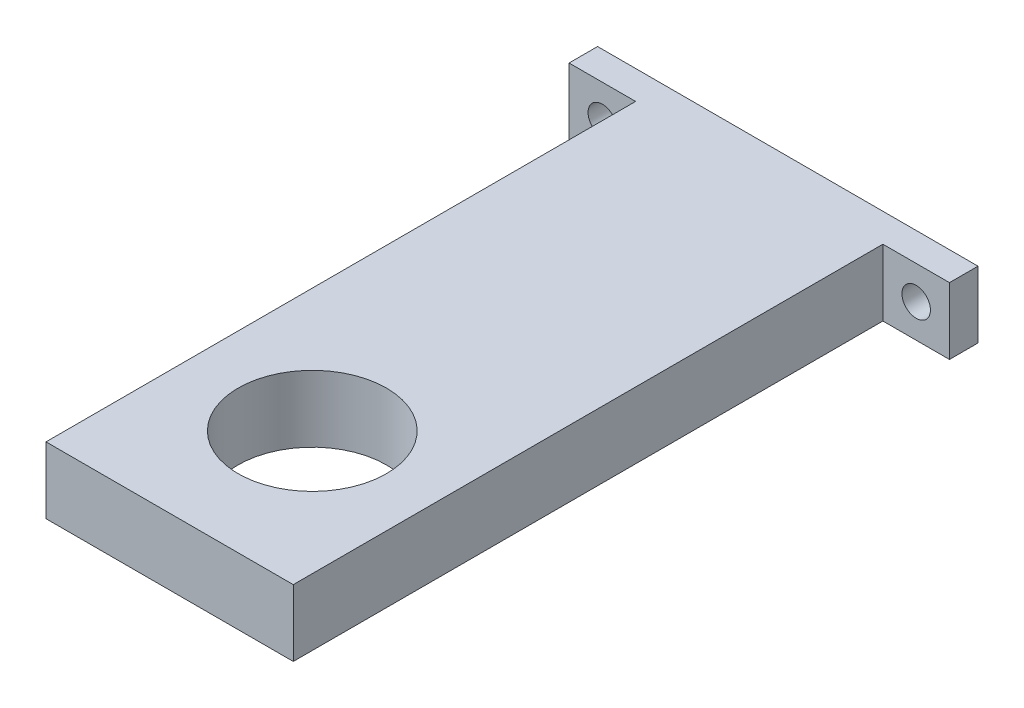
ISO-10303-21;
HEADER;
FILE_DESCRIPTION(('STEP AP214'),'2;1');
FILE_NAME('part.step','',(''),(''),'','','');
FILE_SCHEMA(('AUTOMOTIVE_DESIGN { 1 0 10303 214 1 1 1 1 }'));
ENDSEC;
DATA;
#1=APPLICATION_CONTEXT('core data for automotive mechanical design processes');
#2=APPLICATION_PROTOCOL_DEFINITION('international standard','automotive_design',2000,#1);
#3=PRODUCT_CONTEXT('',#1,'mechanical');
#4=PRODUCT('Part','Part','',(#3));
#5=PRODUCT_RELATED_PRODUCT_CATEGORY('part','',(#4));
#6=PRODUCT_DEFINITION_FORMATION('','',#4);
#7=PRODUCT_DEFINITION_CONTEXT('part definition',#1,'design');
#8=PRODUCT_DEFINITION('design','',#6,#7);
#9=PRODUCT_DEFINITION_SHAPE('','',#8);
#10=(LENGTH_UNIT() NAMED_UNIT(*) SI_UNIT(.MILLI.,.METRE.));
#11=(NAMED_UNIT(*) PLANE_ANGLE_UNIT() SI_UNIT($,.RADIAN.));
#12=(NAMED_UNIT(*) SI_UNIT($,.STERADIAN.) SOLID_ANGLE_UNIT());
#13=UNCERTAINTY_MEASURE_WITH_UNIT(LENGTH_MEASURE(1.E-05),#10,'distance_accuracy_value','');
#14=(GEOMETRIC_REPRESENTATION_CONTEXT(3) GLOBAL_UNCERTAINTY_ASSIGNED_CONTEXT((#13)) GLOBAL_UNIT_ASSIGNED_CONTEXT((#10,
#11,#12)) REPRESENTATION_CONTEXT('',''));
#15=CARTESIAN_POINT('',(0.,0.,0.));
#16=DIRECTION('',(0.,0.,1.));
#17=DIRECTION('',(1.,0.,0.));
#18=AXIS2_PLACEMENT_3D('',#15,#16,#17);
#19=CARTESIAN_POINT('',(0.,0.,3.));
#20=DIRECTION('',(0.,0.,1.));
#21=DIRECTION('',(1.,0.,0.));
#22=AXIS2_PLACEMENT_3D('',#19,#20,#21);
#23=PLANE('',#22);
#24=CARTESIAN_POINT('',(-16.5,0.,3.));
#25=DIRECTION('',(0.,0.,1.));
#26=DIRECTION('',(1.,0.,0.));
#27=AXIS2_PLACEMENT_3D('',#24,#25,#26);
#28=CIRCLE('',#27,1.5);
#29=CARTESIAN_POINT('',(-15.,0.,3.));
#30=VERTEX_POINT('',#29);
#31=EDGE_CURVE('E156',#30,#30,#28,.T.);
#32=ORIENTED_EDGE('',*,*,#31,.F.);
#33=EDGE_LOOP('',(#32));
#34=FACE_BOUND('',#33,.T.);
#35=DIRECTION('',(0.,-1.,0.));
#36=VECTOR('',#35,1.);
#37=CARTESIAN_POINT('',(-13.,3.5,3.));
#38=LINE('',#37,#36);
#39=CARTESIAN_POINT('',(-13.,3.5,3.));
#40=VERTEX_POINT('',#39);
#41=CARTESIAN_POINT('',(-13.,-3.5,3.));
#42=VERTEX_POINT('',#41);
#43=EDGE_CURVE('E121',#40,#42,#38,.T.);
#44=ORIENTED_EDGE('',*,*,#43,.F.);
#45=DIRECTION('',(-1.,0.,0.));
#46=VECTOR('',#45,1.);
#47=CARTESIAN_POINT('',(-20.,3.5,3.));
#48=LINE('',#47,#46);
#49=CARTESIAN_POINT('',(-20.,3.5,3.));
#50=VERTEX_POINT('',#49);
#51=EDGE_CURVE('E134',#40,#50,#48,.T.);
#52=ORIENTED_EDGE('',*,*,#51,.T.);
#53=DIRECTION('',(0.,-1.,0.));
#54=VECTOR('',#53,1.);
#55=CARTESIAN_POINT('',(-20.,3.5,3.));
#56=LINE('',#55,#54);
#57=CARTESIAN_POINT('',(-20.,-3.5,3.));
#58=VERTEX_POINT('',#57);
#59=EDGE_CURVE('E138',#50,#58,#56,.T.);
#60=ORIENTED_EDGE('',*,*,#59,.T.);
#61=DIRECTION('',(1.,0.,0.));
#62=VECTOR('',#61,1.);
#63=CARTESIAN_POINT('',(-20.,-3.5,3.));
#64=LINE('',#63,#62);
#65=EDGE_CURVE('E58',#58,#42,#64,.T.);
#66=ORIENTED_EDGE('',*,*,#65,.T.);
#67=EDGE_LOOP('',(#44,#52,#60,#66));
#68=FACE_BOUND('',#67,.T.);
#69=ADVANCED_FACE('F33',(#34,#68),#23,.T.);
#70=CARTESIAN_POINT('',(20.,3.5,3.));
#71=DIRECTION('',(-1.,0.,0.));
#72=DIRECTION('',(0.,0.,1.));
#73=AXIS2_PLACEMENT_3D('',#70,#71,#72);
#74=PLANE('',#73);
#75=DIRECTION('',(0.,1.,0.));
#76=VECTOR('',#75,1.);
#77=CARTESIAN_POINT('',(20.,3.5,0.));
#78=LINE('',#77,#76);
#79=CARTESIAN_POINT('',(20.,-3.5,0.));
#80=VERTEX_POINT('',#79);
#81=CARTESIAN_POINT('',(20.,3.5,0.));
#82=VERTEX_POINT('',#81);
#83=EDGE_CURVE('E122',#80,#82,#78,.T.);
#84=ORIENTED_EDGE('',*,*,#83,.T.);
#85=DIRECTION('',(0.,0.,-1.));
#86=VECTOR('',#85,1.);
#87=CARTESIAN_POINT('',(20.,3.5,3.));
#88=LINE('',#87,#86);
#89=CARTESIAN_POINT('',(20.,3.5,3.));
#90=VERTEX_POINT('',#89);
#91=EDGE_CURVE('E11',#90,#82,#88,.T.);
#92=ORIENTED_EDGE('',*,*,#91,.F.);
#93=DIRECTION('',(0.,1.,0.));
#94=VECTOR('',#93,1.);
#95=CARTESIAN_POINT('',(20.,3.5,3.));
#96=LINE('',#95,#94);
#97=CARTESIAN_POINT('',(20.,-3.5,3.));
#98=VERTEX_POINT('',#97);
#99=EDGE_CURVE('E131',#98,#90,#96,.T.);
#100=ORIENTED_EDGE('',*,*,#99,.F.);
#101=DIRECTION('',(0.,0.,-1.));
#102=VECTOR('',#101,1.);
#103=CARTESIAN_POINT('',(20.,-3.5,3.));
#104=LINE('',#103,#102);
#105=EDGE_CURVE('E141',#98,#80,#104,.T.);
#106=ORIENTED_EDGE('',*,*,#105,.T.);
#107=EDGE_LOOP('',(#84,#92,#100,#106));
#108=FACE_BOUND('',#107,.T.);
#109=ADVANCED_FACE('F35',(#108),#74,.F.);
#110=CARTESIAN_POINT('',(-20.,3.5,3.));
#111=DIRECTION('',(0.,-1.,0.));
#112=DIRECTION('',(0.,0.,-1.));
#113=AXIS2_PLACEMENT_3D('',#110,#111,#112);
#114=PLANE('',#113);
#115=CARTESIAN_POINT('',(0.,3.5,50.));
#116=DIRECTION('',(0.,-1.,0.));
#117=DIRECTION('',(0.,0.,-1.));
#118=AXIS2_PLACEMENT_3D('',#115,#116,#117);
#119=CIRCLE('',#118,7.8);
#120=CARTESIAN_POINT('',(0.,3.5,42.2));
#121=VERTEX_POINT('',#120);
#122=EDGE_CURVE('E160',#121,#121,#119,.T.);
#123=ORIENTED_EDGE('',*,*,#122,.T.);
#124=EDGE_LOOP('',(#123));
#125=FACE_BOUND('',#124,.T.);
#126=DIRECTION('',(-1.,0.,0.));
#127=VECTOR('',#126,1.);
#128=CARTESIAN_POINT('',(-20.,3.5,0.));
#129=LINE('',#128,#127);
#130=CARTESIAN_POINT('',(-20.,3.5,0.));
#131=VERTEX_POINT('',#130);
#132=EDGE_CURVE('E125',#82,#131,#129,.T.);
#133=ORIENTED_EDGE('',*,*,#132,.T.);
#134=DIRECTION('',(0.,0.,-1.));
#135=VECTOR('',#134,1.);
#136=CARTESIAN_POINT('',(-20.,3.5,3.));
#137=LINE('',#136,#135);
#138=EDGE_CURVE('E42',#50,#131,#137,.T.);
#139=ORIENTED_EDGE('',*,*,#138,.F.);
#140=ORIENTED_EDGE('',*,*,#51,.F.);
#141=DIRECTION('',(0.,0.,-1.));
#142=VECTOR('',#141,1.);
#143=CARTESIAN_POINT('',(-13.,3.5,65.));
#144=LINE('',#143,#142);
#145=CARTESIAN_POINT('',(-13.,3.5,65.));
#146=VERTEX_POINT('',#145);
#147=EDGE_CURVE('E174',#146,#40,#144,.T.);
#148=ORIENTED_EDGE('',*,*,#147,.F.);
#149=DIRECTION('',(-1.,0.,0.));
#150=VECTOR('',#149,1.);
#151=CARTESIAN_POINT('',(-13.,3.5,65.));
#152=LINE('',#151,#150);
#153=CARTESIAN_POINT('',(13.,3.5,65.));
#154=VERTEX_POINT('',#153);
#155=EDGE_CURVE('E115',#154,#146,#152,.T.);
#156=ORIENTED_EDGE('',*,*,#155,.F.);
#157=DIRECTION('',(0.,0.,-1.));
#158=VECTOR('',#157,1.);
#159=CARTESIAN_POINT('',(13.,3.5,65.));
#160=LINE('',#159,#158);
#161=CARTESIAN_POINT('',(13.,3.5,3.));
#162=VERTEX_POINT('',#161);
#163=EDGE_CURVE('E127',#154,#162,#160,.T.);
#164=ORIENTED_EDGE('',*,*,#163,.T.);
#165=EDGE_CURVE('E136',#90,#162,#48,.T.);
#166=ORIENTED_EDGE('',*,*,#165,.F.);
#167=ORIENTED_EDGE('',*,*,#91,.T.);
#168=EDGE_LOOP('',(#133,#139,#140,#148,#156,#164,#166,#167));
#169=FACE_BOUND('',#168,.T.);
#170=ADVANCED_FACE('F180',(#125,#169),#114,.F.);
#171=CARTESIAN_POINT('',(-20.,3.5,3.));
#172=DIRECTION('',(1.,0.,0.));
#173=DIRECTION('',(0.,0.,-1.));
#174=AXIS2_PLACEMENT_3D('',#171,#172,#173);
#175=PLANE('',#174);
#176=DIRECTION('',(0.,-1.,0.));
#177=VECTOR('',#176,1.);
#178=CARTESIAN_POINT('',(-20.,3.5,0.));
#179=LINE('',#178,#177);
#180=CARTESIAN_POINT('',(-20.,-3.5,0.));
#181=VERTEX_POINT('',#180);
#182=EDGE_CURVE('E144',#131,#181,#179,.T.);
#183=ORIENTED_EDGE('',*,*,#182,.T.);
#184=DIRECTION('',(0.,0.,-1.));
#185=VECTOR('',#184,1.);
#186=CARTESIAN_POINT('',(-20.,-3.5,3.));
#187=LINE('',#186,#185);
#188=EDGE_CURVE('E149',#58,#181,#187,.T.);
#189=ORIENTED_EDGE('',*,*,#188,.F.);
#190=ORIENTED_EDGE('',*,*,#59,.F.);
#191=ORIENTED_EDGE('',*,*,#138,.T.);
#192=EDGE_LOOP('',(#183,#189,#190,#191));
#193=FACE_BOUND('',#192,.T.);
#194=ADVANCED_FACE('F209',(#193),#175,.F.);
#195=CARTESIAN_POINT('',(-20.,-3.5,3.));
#196=DIRECTION('',(0.,1.,0.));
#197=DIRECTION('',(0.,0.,1.));
#198=AXIS2_PLACEMENT_3D('',#195,#196,#197);
#199=PLANE('',#198);
#200=CARTESIAN_POINT('',(0.,-3.5,50.));
#201=DIRECTION('',(0.,-1.,0.));
#202=DIRECTION('',(0.,0.,-1.));
#203=AXIS2_PLACEMENT_3D('',#200,#201,#202);
#204=CIRCLE('',#203,7.8);
#205=CARTESIAN_POINT('',(0.,-3.5,42.2));
#206=VERTEX_POINT('',#205);
#207=EDGE_CURVE('E155',#206,#206,#204,.T.);
#208=ORIENTED_EDGE('',*,*,#207,.F.);
#209=EDGE_LOOP('',(#208));
#210=FACE_BOUND('',#209,.T.);
#211=DIRECTION('',(1.,0.,0.));
#212=VECTOR('',#211,1.);
#213=CARTESIAN_POINT('',(-20.,-3.5,0.));
#214=LINE('',#213,#212);
#215=EDGE_CURVE('E135',#181,#80,#214,.T.);
#216=ORIENTED_EDGE('',*,*,#215,.T.);
#217=ORIENTED_EDGE('',*,*,#105,.F.);
#218=CARTESIAN_POINT('',(13.,-3.5,3.));
#219=VERTEX_POINT('',#218);
#220=EDGE_CURVE('E140',#219,#98,#64,.T.);
#221=ORIENTED_EDGE('',*,*,#220,.F.);
#222=DIRECTION('',(0.,0.,-1.));
#223=VECTOR('',#222,1.);
#224=CARTESIAN_POINT('',(13.,-3.5,65.));
#225=LINE('',#224,#223);
#226=CARTESIAN_POINT('',(13.,-3.5,65.));
#227=VERTEX_POINT('',#226);
#228=EDGE_CURVE('E106',#227,#219,#225,.T.);
#229=ORIENTED_EDGE('',*,*,#228,.F.);
#230=DIRECTION('',(1.,0.,0.));
#231=VECTOR('',#230,1.);
#232=CARTESIAN_POINT('',(-13.,-3.5,65.));
#233=LINE('',#232,#231);
#234=CARTESIAN_POINT('',(-13.,-3.5,65.));
#235=VERTEX_POINT('',#234);
#236=EDGE_CURVE('E99',#235,#227,#233,.T.);
#237=ORIENTED_EDGE('',*,*,#236,.F.);
#238=DIRECTION('',(0.,0.,-1.));
#239=VECTOR('',#238,1.);
#240=CARTESIAN_POINT('',(-13.,-3.5,65.));
#241=LINE('',#240,#239);
#242=EDGE_CURVE('E103',#235,#42,#241,.T.);
#243=ORIENTED_EDGE('',*,*,#242,.T.);
#244=ORIENTED_EDGE('',*,*,#65,.F.);
#245=ORIENTED_EDGE('',*,*,#188,.T.);
#246=EDGE_LOOP('',(#216,#217,#221,#229,#237,#243,#244,#245));
#247=FACE_BOUND('',#246,.T.);
#248=ADVANCED_FACE('F101',(#210,#247),#199,.F.);
#249=CARTESIAN_POINT('',(16.5,0.,3.));
#250=DIRECTION('',(0.,0.,1.));
#251=DIRECTION('',(1.,0.,0.));
#252=AXIS2_PLACEMENT_3D('',#249,#250,#251);
#253=CIRCLE('',#252,1.5);
#254=CARTESIAN_POINT('',(18.,0.,3.));
#255=VERTEX_POINT('',#254);
#256=EDGE_CURVE('E167',#255,#255,#253,.T.);
#257=ORIENTED_EDGE('',*,*,#256,.F.);
#258=EDGE_LOOP('',(#257));
#259=FACE_BOUND('',#258,.T.);
#260=DIRECTION('',(0.,1.,0.));
#261=VECTOR('',#260,1.);
#262=CARTESIAN_POINT('',(13.,3.5,3.));
#263=LINE('',#262,#261);
#264=EDGE_CURVE('E50',#219,#162,#263,.T.);
#265=ORIENTED_EDGE('',*,*,#264,.F.);
#266=ORIENTED_EDGE('',*,*,#220,.T.);
#267=ORIENTED_EDGE('',*,*,#99,.T.);
#268=ORIENTED_EDGE('',*,*,#165,.T.);
#269=EDGE_LOOP('',(#265,#266,#267,#268));
#270=FACE_BOUND('',#269,.T.);
#271=ADVANCED_FACE('F196',(#259,#270),#23,.T.);
#272=CARTESIAN_POINT('',(0.,0.,0.));
#273=DIRECTION('',(0.,0.,1.));
#274=DIRECTION('',(1.,0.,0.));
#275=AXIS2_PLACEMENT_3D('',#272,#273,#274);
#276=PLANE('',#275);
#277=CARTESIAN_POINT('',(16.5,0.,0.));
#278=DIRECTION('',(0.,0.,1.));
#279=DIRECTION('',(1.,0.,0.));
#280=AXIS2_PLACEMENT_3D('',#277,#278,#279);
#281=CIRCLE('',#280,1.5);
#282=CARTESIAN_POINT('',(18.,0.,0.));
#283=VERTEX_POINT('',#282);
#284=EDGE_CURVE('E37',#283,#283,#281,.T.);
#285=ORIENTED_EDGE('',*,*,#284,.T.);
#286=EDGE_LOOP('',(#285));
#287=FACE_BOUND('',#286,.T.);
#288=CARTESIAN_POINT('',(-16.5,0.,0.));
#289=DIRECTION('',(0.,0.,1.));
#290=DIRECTION('',(1.,0.,0.));
#291=AXIS2_PLACEMENT_3D('',#288,#289,#290);
#292=CIRCLE('',#291,1.5);
#293=CARTESIAN_POINT('',(-15.,0.,0.));
#294=VERTEX_POINT('',#293);
#295=EDGE_CURVE('E153',#294,#294,#292,.T.);
#296=ORIENTED_EDGE('',*,*,#295,.T.);
#297=EDGE_LOOP('',(#296));
#298=FACE_BOUND('',#297,.T.);
#299=ORIENTED_EDGE('',*,*,#83,.F.);
#300=ORIENTED_EDGE('',*,*,#215,.F.);
#301=ORIENTED_EDGE('',*,*,#182,.F.);
#302=ORIENTED_EDGE('',*,*,#132,.F.);
#303=EDGE_LOOP('',(#299,#300,#301,#302));
#304=FACE_BOUND('',#303,.T.);
#305=ADVANCED_FACE('F191',(#287,#298,#304),#276,.F.);
#306=CARTESIAN_POINT('',(-13.,3.5,65.));
#307=DIRECTION('',(1.,0.,0.));
#308=DIRECTION('',(0.,0.,-1.));
#309=AXIS2_PLACEMENT_3D('',#306,#307,#308);
#310=PLANE('',#309);
#311=ORIENTED_EDGE('',*,*,#43,.T.);
#312=ORIENTED_EDGE('',*,*,#242,.F.);
#313=DIRECTION('',(0.,-1.,0.));
#314=VECTOR('',#313,1.);
#315=CARTESIAN_POINT('',(-13.,3.5,65.));
#316=LINE('',#315,#314);
#317=EDGE_CURVE('E110',#146,#235,#316,.T.);
#318=ORIENTED_EDGE('',*,*,#317,.F.);
#319=ORIENTED_EDGE('',*,*,#147,.T.);
#320=EDGE_LOOP('',(#311,#312,#318,#319));
#321=FACE_BOUND('',#320,.T.);
#322=ADVANCED_FACE('F120',(#321),#310,.F.);
#323=CARTESIAN_POINT('',(13.,3.5,65.));
#324=DIRECTION('',(-1.,0.,0.));
#325=DIRECTION('',(0.,0.,1.));
#326=AXIS2_PLACEMENT_3D('',#323,#324,#325);
#327=PLANE('',#326);
#328=ORIENTED_EDGE('',*,*,#264,.T.);
#329=ORIENTED_EDGE('',*,*,#163,.F.);
#330=DIRECTION('',(0.,1.,0.));
#331=VECTOR('',#330,1.);
#332=CARTESIAN_POINT('',(13.,3.5,65.));
#333=LINE('',#332,#331);
#334=EDGE_CURVE('E109',#227,#154,#333,.T.);
#335=ORIENTED_EDGE('',*,*,#334,.F.);
#336=ORIENTED_EDGE('',*,*,#228,.T.);
#337=EDGE_LOOP('',(#328,#329,#335,#336));
#338=FACE_BOUND('',#337,.T.);
#339=ADVANCED_FACE('F182',(#338),#327,.F.);
#340=CARTESIAN_POINT('',(0.,0.,65.));
#341=DIRECTION('',(0.,0.,1.));
#342=DIRECTION('',(1.,0.,0.));
#343=AXIS2_PLACEMENT_3D('',#340,#341,#342);
#344=PLANE('',#343);
#345=ORIENTED_EDGE('',*,*,#317,.T.);
#346=ORIENTED_EDGE('',*,*,#236,.T.);
#347=ORIENTED_EDGE('',*,*,#334,.T.);
#348=ORIENTED_EDGE('',*,*,#155,.T.);
#349=EDGE_LOOP('',(#345,#346,#347,#348));
#350=FACE_BOUND('',#349,.T.);
#351=ADVANCED_FACE('F113',(#350),#344,.T.);
#352=CARTESIAN_POINT('',(0.,3.5,50.));
#353=DIRECTION('',(0.,-1.,0.));
#354=DIRECTION('',(0.,0.,-1.));
#355=AXIS2_PLACEMENT_3D('',#352,#353,#354);
#356=CYLINDRICAL_SURFACE('',#355,7.8);
#357=ORIENTED_EDGE('',*,*,#122,.F.);
#358=EDGE_LOOP('',(#357));
#359=FACE_BOUND('',#358,.T.);
#360=ORIENTED_EDGE('',*,*,#207,.T.);
#361=EDGE_LOOP('',(#360));
#362=FACE_BOUND('',#361,.T.);
#363=ADVANCED_FACE('F189',(#359,#362),#356,.F.);
#364=CARTESIAN_POINT('',(-16.5,0.,-4.));
#365=DIRECTION('',(0.,0.,1.));
#366=DIRECTION('',(1.,0.,0.));
#367=AXIS2_PLACEMENT_3D('',#364,#365,#366);
#368=CYLINDRICAL_SURFACE('',#367,1.5);
#369=ORIENTED_EDGE('',*,*,#31,.T.);
#370=EDGE_LOOP('',(#369));
#371=FACE_BOUND('',#370,.T.);
#372=ORIENTED_EDGE('',*,*,#295,.F.);
#373=EDGE_LOOP('',(#372));
#374=FACE_BOUND('',#373,.T.);
#375=ADVANCED_FACE('F218',(#371,#374),#368,.F.);
#376=CARTESIAN_POINT('',(16.5,0.,-4.));
#377=DIRECTION('',(0.,0.,1.));
#378=DIRECTION('',(1.,0.,0.));
#379=AXIS2_PLACEMENT_3D('',#376,#377,#378);
#380=CYLINDRICAL_SURFACE('',#379,1.5);
#381=ORIENTED_EDGE('',*,*,#256,.T.);
#382=EDGE_LOOP('',(#381));
#383=FACE_BOUND('',#382,.T.);
#384=ORIENTED_EDGE('',*,*,#284,.F.);
#385=EDGE_LOOP('',(#384));
#386=FACE_BOUND('',#385,.T.);
#387=ADVANCED_FACE('F215',(#383,#386),#380,.F.);
#388=CLOSED_SHELL('',(#69,#109,#170,#194,#248,#271,#305,#322,#339,#351,#363,#375,#387));
#389=MANIFOLD_SOLID_BREP('B2',#388);
#390=ADVANCED_BREP_SHAPE_REPRESENTATION('',(#18,#389),#14);
#391=SHAPE_DEFINITION_REPRESENTATION(#9,#390);
ENDSEC;
END-ISO-10303-21;
